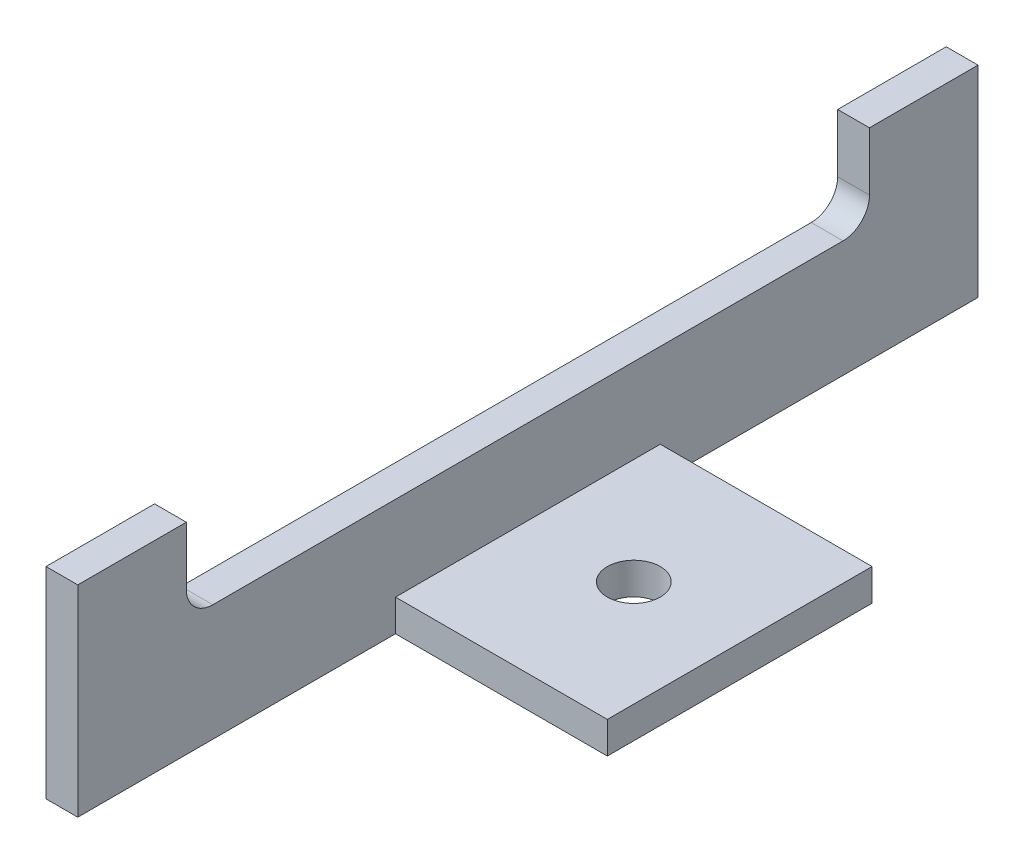
ISO-10303-21;
HEADER;
FILE_DESCRIPTION(('STEP AP214'),'2;1');
FILE_NAME('part.step','',(''),(''),'','','');
FILE_SCHEMA(('AUTOMOTIVE_DESIGN { 1 0 10303 214 1 1 1 1 }'));
ENDSEC;
DATA;
#1=APPLICATION_CONTEXT('core data for automotive mechanical design processes');
#2=APPLICATION_PROTOCOL_DEFINITION('international standard','automotive_design',2000,#1);
#3=PRODUCT_CONTEXT('',#1,'mechanical');
#4=PRODUCT('Part','Part','',(#3));
#5=PRODUCT_RELATED_PRODUCT_CATEGORY('part','',(#4));
#6=PRODUCT_DEFINITION_FORMATION('','',#4);
#7=PRODUCT_DEFINITION_CONTEXT('part definition',#1,'design');
#8=PRODUCT_DEFINITION('design','',#6,#7);
#9=PRODUCT_DEFINITION_SHAPE('','',#8);
#10=(LENGTH_UNIT() NAMED_UNIT(*) SI_UNIT(.MILLI.,.METRE.));
#11=(NAMED_UNIT(*) PLANE_ANGLE_UNIT() SI_UNIT($,.RADIAN.));
#12=(NAMED_UNIT(*) SI_UNIT($,.STERADIAN.) SOLID_ANGLE_UNIT());
#13=UNCERTAINTY_MEASURE_WITH_UNIT(LENGTH_MEASURE(1.E-05),#10,'distance_accuracy_value','');
#14=(GEOMETRIC_REPRESENTATION_CONTEXT(3) GLOBAL_UNCERTAINTY_ASSIGNED_CONTEXT((#13)) GLOBAL_UNIT_ASSIGNED_CONTEXT((#10,
#11,#12)) REPRESENTATION_CONTEXT('',''));
#15=CARTESIAN_POINT('',(0.,0.,0.));
#16=DIRECTION('',(0.,0.,1.));
#17=DIRECTION('',(1.,0.,0.));
#18=AXIS2_PLACEMENT_3D('',#15,#16,#17);
#19=CARTESIAN_POINT('',(8.88178419700125E-13,-8.32667268468867E-13,170.));
#20=DIRECTION('',(0.,1.,0.));
#21=DIRECTION('',(0.,0.,0.999999999999986));
#22=AXIS2_PLACEMENT_3D('',#19,#20,#21);
#23=PLANE('',#22);
#24=CARTESIAN_POINT('',(25.9999999999995,-2.22044604925031E-13,84.9999999999998));
#25=DIRECTION('',(0.,-1.,0.));
#26=DIRECTION('',(0.,0.,-0.999999999999987));
#27=AXIS2_PLACEMENT_3D('',#24,#25,#26);
#28=CIRCLE('',#27,5.0000000000002);
#29=CARTESIAN_POINT('',(25.9999999999995,-2.52853293858381E-13,79.9999999999997));
#30=VERTEX_POINT('',#29);
#31=EDGE_CURVE('E329',#30,#30,#28,.T.);
#32=ORIENTED_EDGE('',*,*,#31,.F.);
#33=EDGE_LOOP('',(#32));
#34=FACE_BOUND('',#33,.T.);
#35=DIRECTION('',(-0.999999999999992,0.,0.));
#36=VECTOR('',#35,1.);
#37=CARTESIAN_POINT('',(8.88178419700125E-13,-1.88737914186277E-12,60.));
#38=LINE('',#37,#36);
#39=CARTESIAN_POINT('',(46.0000000000008,-1.4432899320127E-12,60.0000000000001));
#40=VERTEX_POINT('',#39);
#41=CARTESIAN_POINT('',(6.00000000000161,-2.44249065417534E-12,59.9999999999997));
#42=VERTEX_POINT('',#41);
#43=EDGE_CURVE('E205',#40,#42,#38,.T.);
#44=ORIENTED_EDGE('',*,*,#43,.F.);
#45=DIRECTION('',(0.,0.,-0.999999999999986));
#46=VECTOR('',#45,1.);
#47=CARTESIAN_POINT('',(46.0000000000008,-1.4432899320127E-12,60.0000000000001));
#48=LINE('',#47,#46);
#49=CARTESIAN_POINT('',(45.9999999999999,-3.88578058618805E-13,110.));
#50=VERTEX_POINT('',#49);
#51=EDGE_CURVE('E178',#50,#40,#48,.T.);
#52=ORIENTED_EDGE('',*,*,#51,.F.);
#53=DIRECTION('',(-0.99999999999999,0.,0.));
#54=VECTOR('',#53,1.);
#55=CARTESIAN_POINT('',(1.16573417585641E-12,-1.0547118733939E-12,110.));
#56=LINE('',#55,#54);
#57=CARTESIAN_POINT('',(6.00000000000039,0.,110.));
#58=VERTEX_POINT('',#57);
#59=EDGE_CURVE('E195',#50,#58,#56,.T.);
#60=ORIENTED_EDGE('',*,*,#59,.T.);
#61=DIRECTION('',(0.,0.,-0.999999999999986));
#62=VECTOR('',#61,1.);
#63=CARTESIAN_POINT('',(6.00000000000056,-6.66133814775094E-13,4.44089209850063E-13));
#64=LINE('',#63,#62);
#65=CARTESIAN_POINT('',(6.00000000000017,-2.77555756156289E-13,170.));
#66=VERTEX_POINT('',#65);
#67=EDGE_CURVE('E192',#66,#58,#64,.T.);
#68=ORIENTED_EDGE('',*,*,#67,.F.);
#69=DIRECTION('',(0.99999999999999,0.,0.));
#70=VECTOR('',#69,1.);
#71=CARTESIAN_POINT('',(8.88178419700125E-13,-8.32667268468867E-13,170.));
#72=LINE('',#71,#70);
#73=CARTESIAN_POINT('',(8.88178419700125E-13,-8.32667268468867E-13,170.));
#74=VERTEX_POINT('',#73);
#75=EDGE_CURVE('E219',#74,#66,#72,.T.);
#76=ORIENTED_EDGE('',*,*,#75,.F.);
#77=DIRECTION('',(0.,0.,-0.999999999999986));
#78=VECTOR('',#77,1.);
#79=CARTESIAN_POINT('',(8.88178419700125E-13,-8.32667268468867E-13,170.));
#80=LINE('',#79,#78);
#81=CARTESIAN_POINT('',(0.,0.,0.));
#82=VERTEX_POINT('',#81);
#83=EDGE_CURVE('E227',#74,#82,#80,.T.);
#84=ORIENTED_EDGE('',*,*,#83,.T.);
#85=DIRECTION('',(0.99999999999999,0.,0.));
#86=VECTOR('',#85,1.);
#87=CARTESIAN_POINT('',(0.,0.,0.));
#88=LINE('',#87,#86);
#89=CARTESIAN_POINT('',(6.00000000000056,-6.66133814775094E-13,4.44089209850063E-13));
#90=VERTEX_POINT('',#89);
#91=EDGE_CURVE('E218',#82,#90,#88,.T.);
#92=ORIENTED_EDGE('',*,*,#91,.T.);
#93=DIRECTION('',(0.,0.,0.999999999999986));
#94=VECTOR('',#93,1.);
#95=CARTESIAN_POINT('',(6.00000000000056,-6.66133814775094E-13,4.44089209850063E-13));
#96=LINE('',#95,#94);
#97=EDGE_CURVE('E186',#90,#42,#96,.T.);
#98=ORIENTED_EDGE('',*,*,#97,.T.);
#99=EDGE_LOOP('',(#44,#52,#60,#68,#76,#84,#92,#98));
#100=FACE_BOUND('',#99,.T.);
#101=ADVANCED_FACE('F38',(#34,#100),#23,.F.);
#102=CARTESIAN_POINT('',(5.99999999999978,6.00000000000006,170.));
#103=DIRECTION('',(0.,-1.,0.));
#104=DIRECTION('',(0.,0.,-0.999999999999986));
#105=AXIS2_PLACEMENT_3D('',#102,#103,#104);
#106=PLANE('',#105);
#107=CARTESIAN_POINT('',(25.9999999999992,5.99999999999978,84.999999999999));
#108=DIRECTION('',(0.,-1.,0.));
#109=DIRECTION('',(0.,0.,-0.999999999999986));
#110=AXIS2_PLACEMENT_3D('',#107,#108,#109);
#111=CIRCLE('',#110,5.0000000000002);
#112=CARTESIAN_POINT('',(25.9999999999993,5.99999999999975,79.9999999999989));
#113=VERTEX_POINT('',#112);
#114=EDGE_CURVE('E174',#113,#113,#111,.F.);
#115=ORIENTED_EDGE('',*,*,#114,.F.);
#116=EDGE_LOOP('',(#115));
#117=FACE_BOUND('',#116,.T.);
#118=DIRECTION('',(0.99999999999999,0.,0.));
#119=VECTOR('',#118,1.);
#120=CARTESIAN_POINT('',(3.33066907387547E-13,5.99999999999989,110.));
#121=LINE('',#120,#119);
#122=CARTESIAN_POINT('',(6.00000000000017,5.99999999999945,110.));
#123=VERTEX_POINT('',#122);
#124=CARTESIAN_POINT('',(46.0000000000013,5.99999999999884,110.));
#125=VERTEX_POINT('',#124);
#126=EDGE_CURVE('E187',#123,#125,#121,.T.);
#127=ORIENTED_EDGE('',*,*,#126,.T.);
#128=DIRECTION('',(0.,0.,-0.999999999999986));
#129=VECTOR('',#128,1.);
#130=CARTESIAN_POINT('',(46.0000000000005,5.99999999999956,170.));
#131=LINE('',#130,#129);
#132=CARTESIAN_POINT('',(46.0000000000001,5.9999999999989,60.0000000000007));
#133=VERTEX_POINT('',#132);
#134=EDGE_CURVE('E183',#125,#133,#131,.T.);
#135=ORIENTED_EDGE('',*,*,#134,.T.);
#136=DIRECTION('',(0.999999999999992,0.,0.));
#137=VECTOR('',#136,1.);
#138=CARTESIAN_POINT('',(1.66533453693773E-12,5.99999999999723,60.0000000000002));
#139=LINE('',#138,#137);
#140=CARTESIAN_POINT('',(6.00000000000012,5.99999999999951,60.0000000000001));
#141=VERTEX_POINT('',#140);
#142=EDGE_CURVE('E196',#141,#133,#139,.T.);
#143=ORIENTED_EDGE('',*,*,#142,.F.);
#144=DIRECTION('',(0.,0.,-0.999999999999986));
#145=VECTOR('',#144,1.);
#146=CARTESIAN_POINT('',(5.99999999999978,6.00000000000006,170.));
#147=LINE('',#146,#145);
#148=EDGE_CURVE('E236',#123,#141,#147,.T.);
#149=ORIENTED_EDGE('',*,*,#148,.F.);
#150=EDGE_LOOP('',(#127,#135,#143,#149));
#151=FACE_BOUND('',#150,.T.);
#152=ADVANCED_FACE('F287',(#117,#151),#106,.F.);
#153=CARTESIAN_POINT('',(0.,0.,0.));
#154=DIRECTION('',(0.,0.,-0.999999999999986));
#155=DIRECTION('',(-0.99999999999999,0.,0.));
#156=AXIS2_PLACEMENT_3D('',#153,#154,#155);
#157=PLANE('',#156);
#158=DIRECTION('',(-0.99999999999999,0.,0.));
#159=VECTOR('',#158,1.);
#160=CARTESIAN_POINT('',(29.7539470404399,37.9999999999991,4.9960036108132E-13));
#161=LINE('',#160,#159);
#162=CARTESIAN_POINT('',(6.00000000000134,37.9999999999972,1.60982338570648E-12));
#163=VERTEX_POINT('',#162);
#164=CARTESIAN_POINT('',(1.4432899320127E-12,37.9999999999971,1.83186799063151E-12));
#165=VERTEX_POINT('',#164);
#166=EDGE_CURVE('E173',#163,#165,#161,.T.);
#167=ORIENTED_EDGE('',*,*,#166,.F.);
#168=DIRECTION('',(0.,1.,0.));
#169=VECTOR('',#168,1.);
#170=CARTESIAN_POINT('',(6.00000000000156,5.99999999999717,1.94289029309402E-12));
#171=LINE('',#170,#169);
#172=EDGE_CURVE('E230',#90,#163,#171,.T.);
#173=ORIENTED_EDGE('',*,*,#172,.F.);
#174=ORIENTED_EDGE('',*,*,#91,.F.);
#175=DIRECTION('',(0.,-1.,0.));
#176=VECTOR('',#175,1.);
#177=CARTESIAN_POINT('',(0.,0.,0.));
#178=LINE('',#177,#176);
#179=EDGE_CURVE('E223',#165,#82,#178,.T.);
#180=ORIENTED_EDGE('',*,*,#179,.F.);
#181=EDGE_LOOP('',(#167,#173,#174,#180));
#182=FACE_BOUND('',#181,.T.);
#183=ADVANCED_FACE('F273',(#182),#157,.T.);
#184=CARTESIAN_POINT('',(5.99999999999978,6.00000000000006,170.));
#185=DIRECTION('',(-0.99999999999999,0.,0.));
#186=DIRECTION('',(0.,0.,0.999999999999986));
#187=AXIS2_PLACEMENT_3D('',#184,#185,#186);
#188=PLANE('',#187);
#189=DIRECTION('',(0.,0.,-0.999999999999986));
#190=VECTOR('',#189,1.);
#191=CARTESIAN_POINT('',(6.00000000000062,21.9999999999997,112.5));
#192=LINE('',#191,#190);
#193=CARTESIAN_POINT('',(6.00000000000001,22.0000000000001,144.5));
#194=VERTEX_POINT('',#193);
#195=CARTESIAN_POINT('',(6.00000000000145,21.9999999999974,25.5000000000008));
#196=VERTEX_POINT('',#195);
#197=EDGE_CURVE('E215',#194,#196,#192,.T.);
#198=ORIENTED_EDGE('',*,*,#197,.F.);
#199=CARTESIAN_POINT('',(5.99999999999995,27.0000000000002,144.5));
#200=DIRECTION('',(-0.99999999999999,0.,0.));
#201=DIRECTION('',(0.,0.,0.999999999999986));
#202=AXIS2_PLACEMENT_3D('',#199,#200,#201);
#203=CIRCLE('',#202,5.);
#204=CARTESIAN_POINT('',(6.00000000000062,26.9999999999996,149.5));
#205=VERTEX_POINT('',#204);
#206=EDGE_CURVE('E250',#194,#205,#203,.T.);
#207=ORIENTED_EDGE('',*,*,#206,.T.);
#208=DIRECTION('',(0.,-1.,0.));
#209=VECTOR('',#208,1.);
#210=CARTESIAN_POINT('',(6.00000000000017,34.9999999999992,149.499999999999));
#211=LINE('',#210,#209);
#212=CARTESIAN_POINT('',(5.99999999999984,38.0000000000001,149.5));
#213=VERTEX_POINT('',#212);
#214=EDGE_CURVE('E148',#213,#205,#211,.T.);
#215=ORIENTED_EDGE('',*,*,#214,.F.);
#216=DIRECTION('',(0.,0.,-0.999999999999987));
#217=VECTOR('',#216,1.);
#218=CARTESIAN_POINT('',(6.00000000000095,37.9999999999994,170.));
#219=LINE('',#218,#217);
#220=CARTESIAN_POINT('',(6.00000000000095,37.9999999999994,170.));
#221=VERTEX_POINT('',#220);
#222=EDGE_CURVE('E156',#221,#213,#219,.T.);
#223=ORIENTED_EDGE('',*,*,#222,.F.);
#224=DIRECTION('',(0.,1.,0.));
#225=VECTOR('',#224,1.);
#226=CARTESIAN_POINT('',(5.99999999999978,6.00000000000006,170.));
#227=LINE('',#226,#225);
#228=EDGE_CURVE('E222',#66,#221,#227,.T.);
#229=ORIENTED_EDGE('',*,*,#228,.F.);
#230=ORIENTED_EDGE('',*,*,#67,.T.);
#231=DIRECTION('',(0.,-1.,0.));
#232=VECTOR('',#231,1.);
#233=CARTESIAN_POINT('',(6.0000000000005,80.4043009509526,110.));
#234=LINE('',#233,#232);
#235=EDGE_CURVE('E191',#123,#58,#234,.T.);
#236=ORIENTED_EDGE('',*,*,#235,.F.);
#237=ORIENTED_EDGE('',*,*,#148,.T.);
#238=DIRECTION('',(0.,-1.,0.));
#239=VECTOR('',#238,1.);
#240=CARTESIAN_POINT('',(6.00000000000028,80.4043009509531,59.9999999999997));
#241=LINE('',#240,#239);
#242=EDGE_CURVE('E202',#141,#42,#241,.T.);
#243=ORIENTED_EDGE('',*,*,#242,.T.);
#244=ORIENTED_EDGE('',*,*,#97,.F.);
#245=ORIENTED_EDGE('',*,*,#172,.T.);
#246=DIRECTION('',(0.,0.,-0.999999999999986));
#247=VECTOR('',#246,1.);
#248=CARTESIAN_POINT('',(6.00000000000134,37.9999999999972,1.60982338570648E-12));
#249=LINE('',#248,#247);
#250=CARTESIAN_POINT('',(6.00000000000095,37.9999999999981,20.5000000000012));
#251=VERTEX_POINT('',#250);
#252=EDGE_CURVE('E163',#251,#163,#249,.T.);
#253=ORIENTED_EDGE('',*,*,#252,.F.);
#254=DIRECTION('',(0.,1.,0.));
#255=VECTOR('',#254,1.);
#256=CARTESIAN_POINT('',(6.00000000000112,34.9999999999984,20.5000000000004));
#257=LINE('',#256,#255);
#258=CARTESIAN_POINT('',(6.00000000000017,26.9999999999995,20.5000000000009));
#259=VERTEX_POINT('',#258);
#260=EDGE_CURVE('E149',#259,#251,#257,.T.);
#261=ORIENTED_EDGE('',*,*,#260,.F.);
#262=CARTESIAN_POINT('',(6.00000000000156,26.999999999998,25.500000000001));
#263=DIRECTION('',(-0.99999999999999,0.,0.));
#264=DIRECTION('',(0.,0.,0.999999999999986));
#265=AXIS2_PLACEMENT_3D('',#262,#263,#264);
#266=CIRCLE('',#265,5.);
#267=EDGE_CURVE('E11',#259,#196,#266,.T.);
#268=ORIENTED_EDGE('',*,*,#267,.T.);
#269=EDGE_LOOP('',(#198,#207,#215,#223,#229,#230,#236,#237,#243,#244,#245,#253,#261,#268));
#270=FACE_BOUND('',#269,.T.);
#271=ADVANCED_FACE('F254',(#270),#188,.F.);
#272=CARTESIAN_POINT('',(8.88178419700125E-13,-8.32667268468867E-13,170.));
#273=DIRECTION('',(0.99999999999999,0.,0.));
#274=DIRECTION('',(0.,0.,-0.999999999999986));
#275=AXIS2_PLACEMENT_3D('',#272,#273,#274);
#276=PLANE('',#275);
#277=DIRECTION('',(0.,1.,0.));
#278=VECTOR('',#277,1.);
#279=CARTESIAN_POINT('',(3.33066907387547E-13,34.9999999999999,149.5));
#280=LINE('',#279,#278);
#281=CARTESIAN_POINT('',(0.,27.0000000000001,149.5));
#282=VERTEX_POINT('',#281);
#283=CARTESIAN_POINT('',(3.88578058618805E-13,37.9999999999999,149.5));
#284=VERTEX_POINT('',#283);
#285=EDGE_CURVE('E139',#282,#284,#280,.T.);
#286=ORIENTED_EDGE('',*,*,#285,.F.);
#287=CARTESIAN_POINT('',(2.22044604925031E-13,26.9999999999999,144.5));
#288=DIRECTION('',(0.99999999999999,0.,0.));
#289=DIRECTION('',(0.,0.,-0.999999999999986));
#290=AXIS2_PLACEMENT_3D('',#287,#288,#289);
#291=CIRCLE('',#290,5.);
#292=CARTESIAN_POINT('',(5.55111512312578E-13,21.9999999999994,144.5));
#293=VERTEX_POINT('',#292);
#294=EDGE_CURVE('E248',#282,#293,#291,.T.);
#295=ORIENTED_EDGE('',*,*,#294,.T.);
#296=DIRECTION('',(0.,0.,0.999999999999986));
#297=VECTOR('',#296,1.);
#298=CARTESIAN_POINT('',(7.7715611723761E-13,21.9999999999985,112.5));
#299=LINE('',#298,#297);
#300=CARTESIAN_POINT('',(1.4432899320127E-12,21.9999999999972,25.5000000000017));
#301=VERTEX_POINT('',#300);
#302=EDGE_CURVE('E210',#301,#293,#299,.T.);
#303=ORIENTED_EDGE('',*,*,#302,.F.);
#304=CARTESIAN_POINT('',(6.10622663543836E-13,26.9999999999992,25.4999999999998));
#305=DIRECTION('',(0.99999999999999,0.,0.));
#306=DIRECTION('',(0.,0.,-0.999999999999986));
#307=AXIS2_PLACEMENT_3D('',#304,#305,#306);
#308=CIRCLE('',#307,5.);
#309=CARTESIAN_POINT('',(1.11022302462516E-13,26.9999999999998,20.5000000000004));
#310=VERTEX_POINT('',#309);
#311=EDGE_CURVE('E46',#301,#310,#308,.T.);
#312=ORIENTED_EDGE('',*,*,#311,.T.);
#313=DIRECTION('',(0.,-1.,0.));
#314=VECTOR('',#313,1.);
#315=CARTESIAN_POINT('',(2.22044604925031E-13,34.9999999999998,20.5000000000005));
#316=LINE('',#315,#314);
#317=CARTESIAN_POINT('',(1.49880108324396E-12,37.9999999999974,20.5000000000002));
#318=VERTEX_POINT('',#317);
#319=EDGE_CURVE('E190',#318,#310,#316,.T.);
#320=ORIENTED_EDGE('',*,*,#319,.F.);
#321=DIRECTION('',(0.,0.,0.999999999999986));
#322=VECTOR('',#321,1.);
#323=CARTESIAN_POINT('',(1.4432899320127E-12,37.9999999999971,1.83186799063151E-12));
#324=LINE('',#323,#322);
#325=EDGE_CURVE('E171',#165,#318,#324,.T.);
#326=ORIENTED_EDGE('',*,*,#325,.F.);
#327=ORIENTED_EDGE('',*,*,#179,.T.);
#328=ORIENTED_EDGE('',*,*,#83,.F.);
#329=DIRECTION('',(0.,-1.,0.));
#330=VECTOR('',#329,1.);
#331=CARTESIAN_POINT('',(8.88178419700125E-13,-8.32667268468867E-13,170.));
#332=LINE('',#331,#330);
#333=CARTESIAN_POINT('',(1.33226762955019E-12,37.9999999999989,169.999999999999));
#334=VERTEX_POINT('',#333);
#335=EDGE_CURVE('E162',#334,#74,#332,.T.);
#336=ORIENTED_EDGE('',*,*,#335,.F.);
#337=DIRECTION('',(0.,0.,0.999999999999987));
#338=VECTOR('',#337,1.);
#339=CARTESIAN_POINT('',(1.33226762955019E-12,37.9999999999989,169.999999999999));
#340=LINE('',#339,#338);
#341=EDGE_CURVE('E153',#284,#334,#340,.T.);
#342=ORIENTED_EDGE('',*,*,#341,.F.);
#343=EDGE_LOOP('',(#286,#295,#303,#312,#320,#326,#327,#328,#336,#342));
#344=FACE_BOUND('',#343,.T.);
#345=ADVANCED_FACE('F160',(#344),#276,.F.);
#346=CARTESIAN_POINT('',(8.88178419700125E-13,-8.32667268468867E-13,170.));
#347=DIRECTION('',(0.,0.,-0.999999999999986));
#348=DIRECTION('',(-0.99999999999999,0.,0.));
#349=AXIS2_PLACEMENT_3D('',#346,#347,#348);
#350=PLANE('',#349);
#351=ORIENTED_EDGE('',*,*,#228,.T.);
#352=DIRECTION('',(-0.99999999999999,0.,0.));
#353=VECTOR('',#352,1.);
#354=CARTESIAN_POINT('',(29.7539470404394,38.0000000000001,170.));
#355=LINE('',#354,#353);
#356=EDGE_CURVE('E157',#221,#334,#355,.T.);
#357=ORIENTED_EDGE('',*,*,#356,.T.);
#358=ORIENTED_EDGE('',*,*,#335,.T.);
#359=ORIENTED_EDGE('',*,*,#75,.T.);
#360=EDGE_LOOP('',(#351,#357,#358,#359));
#361=FACE_BOUND('',#360,.T.);
#362=ADVANCED_FACE('F280',(#361),#350,.F.);
#363=CARTESIAN_POINT('',(67.7170964968384,22.0000000000002,112.5));
#364=DIRECTION('',(0.,-1.,0.));
#365=DIRECTION('',(0.,0.,-0.999999999999986));
#366=AXIS2_PLACEMENT_3D('',#363,#364,#365);
#367=PLANE('',#366);
#368=ORIENTED_EDGE('',*,*,#302,.T.);
#369=DIRECTION('',(-0.99999999999999,0.,0.));
#370=VECTOR('',#369,1.);
#371=CARTESIAN_POINT('',(6.00000000000001,22.0000000000001,144.5));
#372=LINE('',#371,#370);
#373=EDGE_CURVE('E245',#293,#194,#372,.F.);
#374=ORIENTED_EDGE('',*,*,#373,.T.);
#375=ORIENTED_EDGE('',*,*,#197,.T.);
#376=DIRECTION('',(-0.99999999999999,0.,0.));
#377=VECTOR('',#376,1.);
#378=CARTESIAN_POINT('',(1.4432899320127E-12,21.9999999999972,25.5000000000017));
#379=LINE('',#378,#377);
#380=EDGE_CURVE('E242',#196,#301,#379,.T.);
#381=ORIENTED_EDGE('',*,*,#380,.T.);
#382=EDGE_LOOP('',(#368,#374,#375,#381));
#383=FACE_BOUND('',#382,.T.);
#384=ADVANCED_FACE('F259',(#383),#367,.F.);
#385=CARTESIAN_POINT('',(67.717096496838,34.9999999999999,149.499999999999));
#386=DIRECTION('',(0.,0.,0.999999999999986));
#387=DIRECTION('',(0.99999999999999,0.,0.));
#388=AXIS2_PLACEMENT_3D('',#385,#386,#387);
#389=PLANE('',#388);
#390=ORIENTED_EDGE('',*,*,#214,.T.);
#391=DIRECTION('',(-0.99999999999999,0.,0.));
#392=VECTOR('',#391,1.);
#393=CARTESIAN_POINT('',(0.,27.0000000000001,149.5));
#394=LINE('',#393,#392);
#395=EDGE_CURVE('E146',#205,#282,#394,.T.);
#396=ORIENTED_EDGE('',*,*,#395,.T.);
#397=ORIENTED_EDGE('',*,*,#285,.T.);
#398=DIRECTION('',(-0.99999999999999,0.,0.));
#399=VECTOR('',#398,1.);
#400=CARTESIAN_POINT('',(29.7539470404397,38.0000000000001,149.5));
#401=LINE('',#400,#399);
#402=EDGE_CURVE('E143',#213,#284,#401,.T.);
#403=ORIENTED_EDGE('',*,*,#402,.F.);
#404=EDGE_LOOP('',(#390,#396,#397,#403));
#405=FACE_BOUND('',#404,.T.);
#406=ADVANCED_FACE('F142',(#405),#389,.F.);
#407=CARTESIAN_POINT('',(67.7170964968388,34.999999999999,20.4999999999999));
#408=DIRECTION('',(0.,0.,-0.999999999999986));
#409=DIRECTION('',(0.,1.,0.));
#410=AXIS2_PLACEMENT_3D('',#407,#408,#409);
#411=PLANE('',#410);
#412=ORIENTED_EDGE('',*,*,#319,.T.);
#413=DIRECTION('',(-0.99999999999999,0.,0.));
#414=VECTOR('',#413,1.);
#415=CARTESIAN_POINT('',(6.00000000000017,26.9999999999995,20.5000000000009));
#416=LINE('',#415,#414);
#417=EDGE_CURVE('E59',#310,#259,#416,.F.);
#418=ORIENTED_EDGE('',*,*,#417,.T.);
#419=ORIENTED_EDGE('',*,*,#260,.T.);
#420=DIRECTION('',(-0.99999999999999,0.,0.));
#421=VECTOR('',#420,1.);
#422=CARTESIAN_POINT('',(29.7539470404399,37.9999999999989,20.5000000000006));
#423=LINE('',#422,#421);
#424=EDGE_CURVE('E165',#251,#318,#423,.T.);
#425=ORIENTED_EDGE('',*,*,#424,.T.);
#426=EDGE_LOOP('',(#412,#418,#419,#425));
#427=FACE_BOUND('',#426,.T.);
#428=ADVANCED_FACE('F265',(#427),#411,.F.);
#429=CARTESIAN_POINT('',(3.33066907387547E-13,80.4043009509525,60.0000000000003));
#430=DIRECTION('',(0.,0.,0.999999999999987));
#431=DIRECTION('',(0.999999999999992,0.,0.));
#432=AXIS2_PLACEMENT_3D('',#429,#430,#431);
#433=PLANE('',#432);
#434=ORIENTED_EDGE('',*,*,#142,.T.);
#435=DIRECTION('',(0.,-1.,0.));
#436=VECTOR('',#435,1.);
#437=CARTESIAN_POINT('',(46.0000000000008,9.99999999999851,60.0000000000003));
#438=LINE('',#437,#436);
#439=EDGE_CURVE('E180',#133,#40,#438,.T.);
#440=ORIENTED_EDGE('',*,*,#439,.T.);
#441=ORIENTED_EDGE('',*,*,#43,.T.);
#442=ORIENTED_EDGE('',*,*,#242,.F.);
#443=EDGE_LOOP('',(#434,#440,#441,#442));
#444=FACE_BOUND('',#443,.T.);
#445=ADVANCED_FACE('F289',(#444),#433,.F.);
#446=CARTESIAN_POINT('',(1.0547118733939E-12,80.4043009509517,110.));
#447=DIRECTION('',(0.,0.,0.999999999999986));
#448=DIRECTION('',(0.99999999999999,0.,0.));
#449=AXIS2_PLACEMENT_3D('',#446,#447,#448);
#450=PLANE('',#449);
#451=DIRECTION('',(0.,-1.,0.));
#452=VECTOR('',#451,1.);
#453=CARTESIAN_POINT('',(46.,80.4043009509531,110.));
#454=LINE('',#453,#452);
#455=EDGE_CURVE('E239',#125,#50,#454,.T.);
#456=ORIENTED_EDGE('',*,*,#455,.F.);
#457=ORIENTED_EDGE('',*,*,#126,.F.);
#458=ORIENTED_EDGE('',*,*,#235,.T.);
#459=ORIENTED_EDGE('',*,*,#59,.F.);
#460=EDGE_LOOP('',(#456,#457,#458,#459));
#461=FACE_BOUND('',#460,.T.);
#462=ADVANCED_FACE('F293',(#461),#450,.T.);
#463=CARTESIAN_POINT('',(46.0000000000008,9.99999999999851,60.0000000000003));
#464=DIRECTION('',(-0.99999999999999,0.,0.));
#465=DIRECTION('',(0.,0.,0.999999999999986));
#466=AXIS2_PLACEMENT_3D('',#463,#464,#465);
#467=PLANE('',#466);
#468=ORIENTED_EDGE('',*,*,#455,.T.);
#469=ORIENTED_EDGE('',*,*,#51,.T.);
#470=ORIENTED_EDGE('',*,*,#439,.F.);
#471=ORIENTED_EDGE('',*,*,#134,.F.);
#472=EDGE_LOOP('',(#468,#469,#470,#471));
#473=FACE_BOUND('',#472,.T.);
#474=ADVANCED_FACE('F294',(#473),#467,.F.);
#475=CARTESIAN_POINT('',(29.7539470404399,37.9999999999991,4.9960036108132E-13));
#476=DIRECTION('',(0.,-1.,0.));
#477=DIRECTION('',(0.,0.,-0.999999999999986));
#478=AXIS2_PLACEMENT_3D('',#475,#476,#477);
#479=PLANE('',#478);
#480=ORIENTED_EDGE('',*,*,#252,.T.);
#481=ORIENTED_EDGE('',*,*,#166,.T.);
#482=ORIENTED_EDGE('',*,*,#325,.T.);
#483=ORIENTED_EDGE('',*,*,#424,.F.);
#484=EDGE_LOOP('',(#480,#481,#482,#483));
#485=FACE_BOUND('',#484,.T.);
#486=ADVANCED_FACE('F267',(#485),#479,.F.);
#487=CARTESIAN_POINT('',(29.7539470404394,38.0000000000001,170.));
#488=DIRECTION('',(0.,-1.,0.));
#489=DIRECTION('',(0.,0.,-0.999999999999987));
#490=AXIS2_PLACEMENT_3D('',#487,#488,#489);
#491=PLANE('',#490);
#492=ORIENTED_EDGE('',*,*,#222,.T.);
#493=ORIENTED_EDGE('',*,*,#402,.T.);
#494=ORIENTED_EDGE('',*,*,#341,.T.);
#495=ORIENTED_EDGE('',*,*,#356,.F.);
#496=EDGE_LOOP('',(#492,#493,#494,#495));
#497=FACE_BOUND('',#496,.T.);
#498=ADVANCED_FACE('F152',(#497),#491,.F.);
#499=CARTESIAN_POINT('',(25.9999999999992,20.1421356237317,84.9999999999997));
#500=DIRECTION('',(0.,-1.,0.));
#501=DIRECTION('',(0.,0.,-0.999999999999987));
#502=AXIS2_PLACEMENT_3D('',#499,#500,#501);
#503=CYLINDRICAL_SURFACE('',#502,5.0000000000002);
#504=ORIENTED_EDGE('',*,*,#114,.T.);
#505=EDGE_LOOP('',(#504));
#506=FACE_BOUND('',#505,.T.);
#507=ORIENTED_EDGE('',*,*,#31,.T.);
#508=EDGE_LOOP('',(#507));
#509=FACE_BOUND('',#508,.T.);
#510=ADVANCED_FACE('F314',(#506,#509),#503,.F.);
#511=CARTESIAN_POINT('',(67.7170964968382,26.9999999999995,144.5));
#512=DIRECTION('',(0.99999999999999,0.,0.));
#513=DIRECTION('',(0.,0.,-0.999999999999986));
#514=AXIS2_PLACEMENT_3D('',#511,#512,#513);
#515=CYLINDRICAL_SURFACE('',#514,5.);
#516=ORIENTED_EDGE('',*,*,#206,.F.);
#517=ORIENTED_EDGE('',*,*,#373,.F.);
#518=ORIENTED_EDGE('',*,*,#294,.F.);
#519=ORIENTED_EDGE('',*,*,#395,.F.);
#520=EDGE_LOOP('',(#516,#517,#518,#519));
#521=FACE_BOUND('',#520,.T.);
#522=ADVANCED_FACE('F257',(#521),#515,.F.);
#523=CARTESIAN_POINT('',(67.7170964968387,26.9999999999977,25.500000000001));
#524=DIRECTION('',(0.99999999999999,0.,0.));
#525=DIRECTION('',(0.,0.,-0.999999999999986));
#526=AXIS2_PLACEMENT_3D('',#523,#524,#525);
#527=CYLINDRICAL_SURFACE('',#526,5.);
#528=ORIENTED_EDGE('',*,*,#267,.F.);
#529=ORIENTED_EDGE('',*,*,#417,.F.);
#530=ORIENTED_EDGE('',*,*,#311,.F.);
#531=ORIENTED_EDGE('',*,*,#380,.F.);
#532=EDGE_LOOP('',(#528,#529,#530,#531));
#533=FACE_BOUND('',#532,.T.);
#534=ADVANCED_FACE('F40',(#533),#527,.F.);
#535=CLOSED_SHELL('',(#101,#152,#183,#271,#345,#362,#384,#406,#428,#445,#462,#474,#486,#498,
#510,#522,#534));
#536=MANIFOLD_SOLID_BREP('B2',#535);
#537=ADVANCED_BREP_SHAPE_REPRESENTATION('',(#18,#536),#14);
#538=SHAPE_DEFINITION_REPRESENTATION(#9,#537);
ENDSEC;
END-ISO-10303-21;
